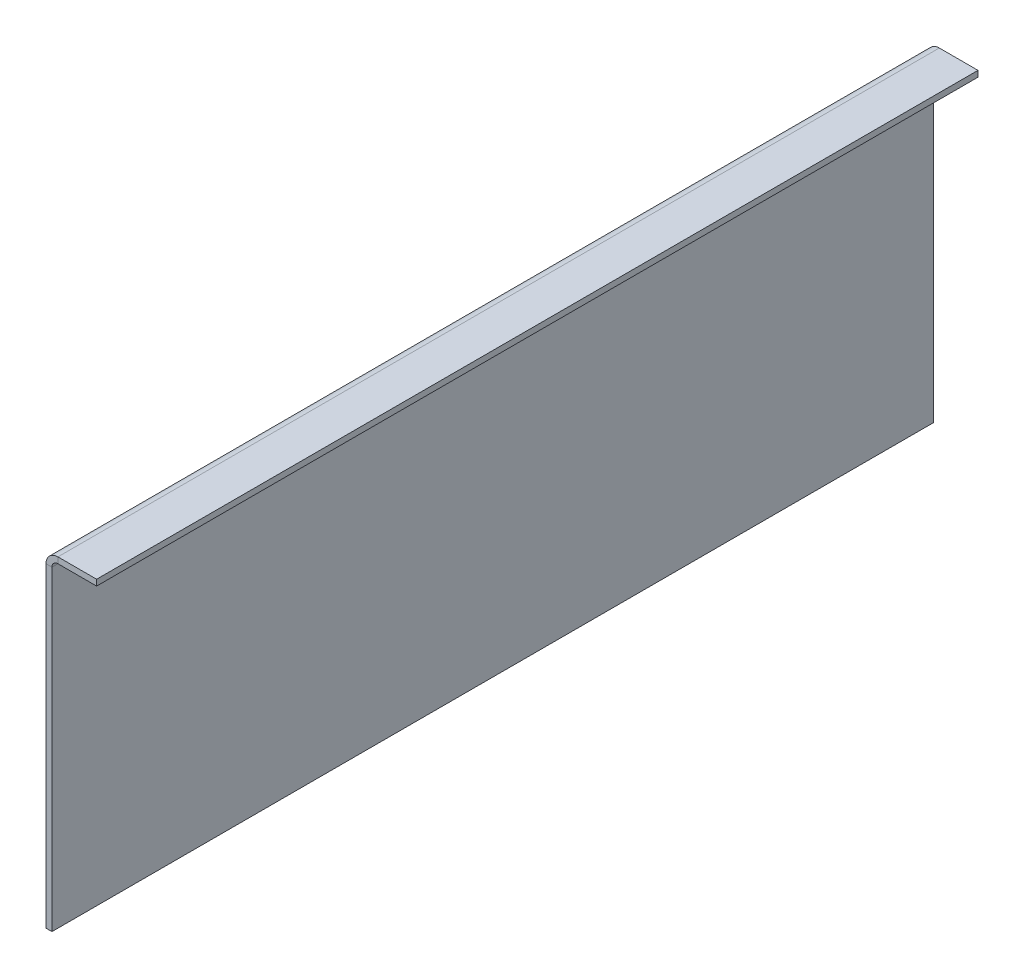
ISO-10303-21;
HEADER;
FILE_DESCRIPTION(('STEP AP214'),'2;1');
FILE_NAME('part.step','',(''),(''),'','','');
FILE_SCHEMA(('AUTOMOTIVE_DESIGN { 1 0 10303 214 1 1 1 1 }'));
ENDSEC;
DATA;
#1=APPLICATION_CONTEXT('core data for automotive mechanical design processes');
#2=APPLICATION_PROTOCOL_DEFINITION('international standard','automotive_design',2000,#1);
#3=PRODUCT_CONTEXT('',#1,'mechanical');
#4=PRODUCT('Part','Part','',(#3));
#5=PRODUCT_RELATED_PRODUCT_CATEGORY('part','',(#4));
#6=PRODUCT_DEFINITION_FORMATION('','',#4);
#7=PRODUCT_DEFINITION_CONTEXT('part definition',#1,'design');
#8=PRODUCT_DEFINITION('design','',#6,#7);
#9=PRODUCT_DEFINITION_SHAPE('','',#8);
#10=(LENGTH_UNIT() NAMED_UNIT(*) SI_UNIT(.MILLI.,.METRE.));
#11=(NAMED_UNIT(*) PLANE_ANGLE_UNIT() SI_UNIT($,.RADIAN.));
#12=(NAMED_UNIT(*) SI_UNIT($,.STERADIAN.) SOLID_ANGLE_UNIT());
#13=UNCERTAINTY_MEASURE_WITH_UNIT(LENGTH_MEASURE(1.E-05),#10,'distance_accuracy_value','');
#14=(GEOMETRIC_REPRESENTATION_CONTEXT(3) GLOBAL_UNCERTAINTY_ASSIGNED_CONTEXT((#13)) GLOBAL_UNIT_ASSIGNED_CONTEXT((#10,
#11,#12)) REPRESENTATION_CONTEXT('',''));
#15=CARTESIAN_POINT('',(0.,0.,0.));
#16=DIRECTION('',(0.,0.,1.));
#17=DIRECTION('',(1.,0.,0.));
#18=AXIS2_PLACEMENT_3D('',#15,#16,#17);
#19=CARTESIAN_POINT('',(17.,108.,-148.));
#20=DIRECTION('',(0.,0.,1.));
#21=DIRECTION('',(1.,0.,0.));
#22=AXIS2_PLACEMENT_3D('',#19,#20,#21);
#23=PLANE('',#22);
#24=DIRECTION('',(0.,-1.,0.));
#25=VECTOR('',#24,1.);
#26=CARTESIAN_POINT('',(3.99999999999999,108.,-148.));
#27=LINE('',#26,#25);
#28=CARTESIAN_POINT('',(3.99999999999999,110.,-148.));
#29=VERTEX_POINT('',#28);
#30=CARTESIAN_POINT('',(3.99999999999999,108.,-148.));
#31=VERTEX_POINT('',#30);
#32=EDGE_CURVE('E11',#29,#31,#27,.T.);
#33=ORIENTED_EDGE('',*,*,#32,.F.);
#34=DIRECTION('',(1.,0.,0.));
#35=VECTOR('',#34,1.);
#36=CARTESIAN_POINT('',(17.,110.,-148.));
#37=LINE('',#36,#35);
#38=CARTESIAN_POINT('',(17.,110.,-148.));
#39=VERTEX_POINT('',#38);
#40=EDGE_CURVE('E95',#29,#39,#37,.T.);
#41=ORIENTED_EDGE('',*,*,#40,.T.);
#42=DIRECTION('',(0.,-1.,0.));
#43=VECTOR('',#42,1.);
#44=CARTESIAN_POINT('',(17.,108.,-148.));
#45=LINE('',#44,#43);
#46=CARTESIAN_POINT('',(17.,108.,-148.));
#47=VERTEX_POINT('',#46);
#48=EDGE_CURVE('E55',#39,#47,#45,.T.);
#49=ORIENTED_EDGE('',*,*,#48,.T.);
#50=DIRECTION('',(1.,0.,0.));
#51=VECTOR('',#50,1.);
#52=CARTESIAN_POINT('',(17.,108.,-148.));
#53=LINE('',#52,#51);
#54=EDGE_CURVE('E98',#31,#47,#53,.T.);
#55=ORIENTED_EDGE('',*,*,#54,.F.);
#56=EDGE_LOOP('',(#33,#41,#49,#55));
#57=FACE_BOUND('',#56,.T.);
#58=ADVANCED_FACE('F45',(#57),#23,.F.);
#59=CARTESIAN_POINT('',(17.,108.,148.));
#60=DIRECTION('',(1.,0.,0.));
#61=DIRECTION('',(0.,0.,-1.));
#62=AXIS2_PLACEMENT_3D('',#59,#60,#61);
#63=PLANE('',#62);
#64=ORIENTED_EDGE('',*,*,#48,.F.);
#65=DIRECTION('',(0.,0.,1.));
#66=VECTOR('',#65,1.);
#67=CARTESIAN_POINT('',(17.,110.,148.));
#68=LINE('',#67,#66);
#69=CARTESIAN_POINT('',(17.,110.,148.));
#70=VERTEX_POINT('',#69);
#71=EDGE_CURVE('E123',#70,#39,#68,.F.);
#72=ORIENTED_EDGE('',*,*,#71,.F.);
#73=DIRECTION('',(0.,-1.,0.));
#74=VECTOR('',#73,1.);
#75=CARTESIAN_POINT('',(17.,108.,148.));
#76=LINE('',#75,#74);
#77=CARTESIAN_POINT('',(17.,108.,148.));
#78=VERTEX_POINT('',#77);
#79=EDGE_CURVE('E141',#70,#78,#76,.T.);
#80=ORIENTED_EDGE('',*,*,#79,.T.);
#81=DIRECTION('',(0.,0.,-1.));
#82=VECTOR('',#81,1.);
#83=CARTESIAN_POINT('',(17.,108.,148.));
#84=LINE('',#83,#82);
#85=EDGE_CURVE('E152',#78,#47,#84,.T.);
#86=ORIENTED_EDGE('',*,*,#85,.T.);
#87=EDGE_LOOP('',(#64,#72,#80,#86));
#88=FACE_BOUND('',#87,.T.);
#89=ADVANCED_FACE('F158',(#88),#63,.T.);
#90=CARTESIAN_POINT('',(17.,108.,148.));
#91=DIRECTION('',(0.,0.,1.));
#92=DIRECTION('',(1.,0.,0.));
#93=AXIS2_PLACEMENT_3D('',#90,#91,#92);
#94=PLANE('',#93);
#95=ORIENTED_EDGE('',*,*,#79,.F.);
#96=DIRECTION('',(1.,0.,0.));
#97=VECTOR('',#96,1.);
#98=CARTESIAN_POINT('',(17.,110.,148.));
#99=LINE('',#98,#97);
#100=CARTESIAN_POINT('',(3.99999999999999,110.,148.));
#101=VERTEX_POINT('',#100);
#102=EDGE_CURVE('E183',#101,#70,#99,.T.);
#103=ORIENTED_EDGE('',*,*,#102,.F.);
#104=DIRECTION('',(0.,-1.,0.));
#105=VECTOR('',#104,1.);
#106=CARTESIAN_POINT('',(3.99999999999999,108.,148.));
#107=LINE('',#106,#105);
#108=CARTESIAN_POINT('',(3.99999999999999,108.,148.));
#109=VERTEX_POINT('',#108);
#110=EDGE_CURVE('E138',#101,#109,#107,.T.);
#111=ORIENTED_EDGE('',*,*,#110,.T.);
#112=DIRECTION('',(1.,0.,0.));
#113=VECTOR('',#112,1.);
#114=CARTESIAN_POINT('',(17.,108.,148.));
#115=LINE('',#114,#113);
#116=EDGE_CURVE('E159',#109,#78,#115,.T.);
#117=ORIENTED_EDGE('',*,*,#116,.T.);
#118=EDGE_LOOP('',(#95,#103,#111,#117));
#119=FACE_BOUND('',#118,.T.);
#120=ADVANCED_FACE('F189',(#119),#94,.T.);
#121=CARTESIAN_POINT('',(3.99999999999999,106.,148.));
#122=DIRECTION('',(0.,0.,1.));
#123=DIRECTION('',(1.,0.,0.));
#124=AXIS2_PLACEMENT_3D('',#121,#122,#123);
#125=PLANE('',#124);
#126=ORIENTED_EDGE('',*,*,#110,.F.);
#127=CARTESIAN_POINT('',(3.99999999999999,106.,148.));
#128=DIRECTION('',(0.,0.,1.));
#129=DIRECTION('',(1.,0.,0.));
#130=AXIS2_PLACEMENT_3D('',#127,#128,#129);
#131=CIRCLE('',#130,4.);
#132=CARTESIAN_POINT('',(0.,106.,148.));
#133=VERTEX_POINT('',#132);
#134=EDGE_CURVE('E113',#101,#133,#131,.T.);
#135=ORIENTED_EDGE('',*,*,#134,.T.);
#136=DIRECTION('',(1.,0.,0.));
#137=VECTOR('',#136,1.);
#138=CARTESIAN_POINT('',(1.99999999999999,106.,148.));
#139=LINE('',#138,#137);
#140=CARTESIAN_POINT('',(1.99999999999999,106.,148.));
#141=VERTEX_POINT('',#140);
#142=EDGE_CURVE('E63',#133,#141,#139,.T.);
#143=ORIENTED_EDGE('',*,*,#142,.T.);
#144=CARTESIAN_POINT('',(3.99999999999999,106.,148.));
#145=DIRECTION('',(0.,0.,-1.));
#146=DIRECTION('',(-1.,0.,0.));
#147=AXIS2_PLACEMENT_3D('',#144,#145,#146);
#148=CIRCLE('',#147,2.);
#149=EDGE_CURVE('E156',#109,#141,#148,.F.);
#150=ORIENTED_EDGE('',*,*,#149,.F.);
#151=EDGE_LOOP('',(#126,#135,#143,#150));
#152=FACE_BOUND('',#151,.T.);
#153=ADVANCED_FACE('F192',(#152),#125,.T.);
#154=CARTESIAN_POINT('',(1.99999999999999,108.,148.));
#155=DIRECTION('',(0.,0.,1.));
#156=DIRECTION('',(0.,1.,0.));
#157=AXIS2_PLACEMENT_3D('',#154,#155,#156);
#158=PLANE('',#157);
#159=ORIENTED_EDGE('',*,*,#142,.F.);
#160=DIRECTION('',(0.,-1.,0.));
#161=VECTOR('',#160,1.);
#162=CARTESIAN_POINT('',(0.,108.,148.));
#163=LINE('',#162,#161);
#164=CARTESIAN_POINT('',(0.,0.,148.));
#165=VERTEX_POINT('',#164);
#166=EDGE_CURVE('E182',#165,#133,#163,.F.);
#167=ORIENTED_EDGE('',*,*,#166,.F.);
#168=DIRECTION('',(1.,0.,0.));
#169=VECTOR('',#168,1.);
#170=CARTESIAN_POINT('',(2.,0.,148.));
#171=LINE('',#170,#169);
#172=CARTESIAN_POINT('',(2.,0.,148.));
#173=VERTEX_POINT('',#172);
#174=EDGE_CURVE('E134',#165,#173,#171,.T.);
#175=ORIENTED_EDGE('',*,*,#174,.T.);
#176=DIRECTION('',(0.,1.,0.));
#177=VECTOR('',#176,1.);
#178=CARTESIAN_POINT('',(1.99999999999999,108.,148.));
#179=LINE('',#178,#177);
#180=EDGE_CURVE('E166',#173,#141,#179,.T.);
#181=ORIENTED_EDGE('',*,*,#180,.T.);
#182=EDGE_LOOP('',(#159,#167,#175,#181));
#183=FACE_BOUND('',#182,.T.);
#184=ADVANCED_FACE('F203',(#183),#158,.T.);
#185=CARTESIAN_POINT('',(2.,0.,148.));
#186=DIRECTION('',(0.,1.,0.));
#187=DIRECTION('',(0.,0.,-1.));
#188=AXIS2_PLACEMENT_3D('',#185,#186,#187);
#189=PLANE('',#188);
#190=ORIENTED_EDGE('',*,*,#174,.F.);
#191=DIRECTION('',(0.,0.,1.));
#192=VECTOR('',#191,1.);
#193=CARTESIAN_POINT('',(0.,0.,148.));
#194=LINE('',#193,#192);
#195=CARTESIAN_POINT('',(0.,0.,-148.));
#196=VERTEX_POINT('',#195);
#197=EDGE_CURVE('E118',#165,#196,#194,.F.);
#198=ORIENTED_EDGE('',*,*,#197,.T.);
#199=DIRECTION('',(1.,0.,0.));
#200=VECTOR('',#199,1.);
#201=CARTESIAN_POINT('',(2.,0.,-148.));
#202=LINE('',#201,#200);
#203=CARTESIAN_POINT('',(2.,0.,-148.));
#204=VERTEX_POINT('',#203);
#205=EDGE_CURVE('E131',#196,#204,#202,.T.);
#206=ORIENTED_EDGE('',*,*,#205,.T.);
#207=DIRECTION('',(0.,0.,-1.));
#208=VECTOR('',#207,1.);
#209=CARTESIAN_POINT('',(2.,0.,148.));
#210=LINE('',#209,#208);
#211=EDGE_CURVE('E169',#173,#204,#210,.T.);
#212=ORIENTED_EDGE('',*,*,#211,.F.);
#213=EDGE_LOOP('',(#190,#198,#206,#212));
#214=FACE_BOUND('',#213,.T.);
#215=ADVANCED_FACE('F209',(#214),#189,.F.);
#216=CARTESIAN_POINT('',(1.99999999999999,108.,-148.));
#217=DIRECTION('',(0.,0.,1.));
#218=DIRECTION('',(0.,1.,0.));
#219=AXIS2_PLACEMENT_3D('',#216,#217,#218);
#220=PLANE('',#219);
#221=ORIENTED_EDGE('',*,*,#205,.F.);
#222=DIRECTION('',(0.,-1.,0.));
#223=VECTOR('',#222,1.);
#224=CARTESIAN_POINT('',(0.,108.,-148.));
#225=LINE('',#224,#223);
#226=CARTESIAN_POINT('',(0.,106.,-148.));
#227=VERTEX_POINT('',#226);
#228=EDGE_CURVE('E180',#196,#227,#225,.F.);
#229=ORIENTED_EDGE('',*,*,#228,.T.);
#230=DIRECTION('',(1.,0.,0.));
#231=VECTOR('',#230,1.);
#232=CARTESIAN_POINT('',(1.99999999999999,106.,-148.));
#233=LINE('',#232,#231);
#234=CARTESIAN_POINT('',(1.99999999999999,106.,-148.));
#235=VERTEX_POINT('',#234);
#236=EDGE_CURVE('E49',#227,#235,#233,.T.);
#237=ORIENTED_EDGE('',*,*,#236,.T.);
#238=DIRECTION('',(0.,1.,0.));
#239=VECTOR('',#238,1.);
#240=CARTESIAN_POINT('',(1.99999999999999,108.,-148.));
#241=LINE('',#240,#239);
#242=EDGE_CURVE('E161',#204,#235,#241,.T.);
#243=ORIENTED_EDGE('',*,*,#242,.F.);
#244=EDGE_LOOP('',(#221,#229,#237,#243));
#245=FACE_BOUND('',#244,.T.);
#246=ADVANCED_FACE('F213',(#245),#220,.F.);
#247=CARTESIAN_POINT('',(3.99999999999999,106.,-148.));
#248=DIRECTION('',(0.,0.,-1.));
#249=DIRECTION('',(-1.,0.,0.));
#250=AXIS2_PLACEMENT_3D('',#247,#248,#249);
#251=PLANE('',#250);
#252=CARTESIAN_POINT('',(3.99999999999999,106.,-148.));
#253=DIRECTION('',(0.,0.,1.));
#254=DIRECTION('',(1.,0.,0.));
#255=AXIS2_PLACEMENT_3D('',#252,#253,#254);
#256=CIRCLE('',#255,4.);
#257=EDGE_CURVE('E111',#227,#29,#256,.F.);
#258=ORIENTED_EDGE('',*,*,#257,.T.);
#259=ORIENTED_EDGE('',*,*,#32,.T.);
#260=CARTESIAN_POINT('',(3.99999999999999,106.,-148.));
#261=DIRECTION('',(0.,0.,1.));
#262=DIRECTION('',(1.,0.,0.));
#263=AXIS2_PLACEMENT_3D('',#260,#261,#262);
#264=CIRCLE('',#263,2.);
#265=EDGE_CURVE('E176',#235,#31,#264,.F.);
#266=ORIENTED_EDGE('',*,*,#265,.F.);
#267=ORIENTED_EDGE('',*,*,#236,.F.);
#268=EDGE_LOOP('',(#258,#259,#266,#267));
#269=FACE_BOUND('',#268,.T.);
#270=ADVANCED_FACE('F47',(#269),#251,.T.);
#271=CARTESIAN_POINT('',(1.99999999999999,108.,148.));
#272=DIRECTION('',(-1.,0.,0.));
#273=DIRECTION('',(0.,-1.,0.));
#274=AXIS2_PLACEMENT_3D('',#271,#272,#273);
#275=PLANE('',#274);
#276=ORIENTED_EDGE('',*,*,#242,.T.);
#277=DIRECTION('',(0.,0.,-1.));
#278=VECTOR('',#277,1.);
#279=CARTESIAN_POINT('',(1.99999999999999,106.,148.));
#280=LINE('',#279,#278);
#281=EDGE_CURVE('E173',#235,#141,#280,.F.);
#282=ORIENTED_EDGE('',*,*,#281,.T.);
#283=ORIENTED_EDGE('',*,*,#180,.F.);
#284=ORIENTED_EDGE('',*,*,#211,.T.);
#285=EDGE_LOOP('',(#276,#282,#283,#284));
#286=FACE_BOUND('',#285,.T.);
#287=ADVANCED_FACE('F208',(#286),#275,.F.);
#288=CARTESIAN_POINT('',(17.,108.,148.));
#289=DIRECTION('',(0.,1.,0.));
#290=DIRECTION('',(0.,0.,1.));
#291=AXIS2_PLACEMENT_3D('',#288,#289,#290);
#292=PLANE('',#291);
#293=ORIENTED_EDGE('',*,*,#116,.F.);
#294=DIRECTION('',(0.,0.,-1.));
#295=VECTOR('',#294,1.);
#296=CARTESIAN_POINT('',(3.99999999999999,108.,-148.));
#297=LINE('',#296,#295);
#298=EDGE_CURVE('E155',#109,#31,#297,.T.);
#299=ORIENTED_EDGE('',*,*,#298,.T.);
#300=ORIENTED_EDGE('',*,*,#54,.T.);
#301=ORIENTED_EDGE('',*,*,#85,.F.);
#302=EDGE_LOOP('',(#293,#299,#300,#301));
#303=FACE_BOUND('',#302,.T.);
#304=ADVANCED_FACE('F151',(#303),#292,.F.);
#305=CARTESIAN_POINT('',(3.99999999999999,106.,148.));
#306=DIRECTION('',(0.,0.,1.));
#307=DIRECTION('',(1.,0.,0.));
#308=AXIS2_PLACEMENT_3D('',#305,#306,#307);
#309=CYLINDRICAL_SURFACE('',#308,2.);
#310=ORIENTED_EDGE('',*,*,#149,.T.);
#311=ORIENTED_EDGE('',*,*,#281,.F.);
#312=ORIENTED_EDGE('',*,*,#265,.T.);
#313=ORIENTED_EDGE('',*,*,#298,.F.);
#314=EDGE_LOOP('',(#310,#311,#312,#313));
#315=FACE_BOUND('',#314,.T.);
#316=ADVANCED_FACE('F195',(#315),#309,.F.);
#317=CARTESIAN_POINT('',(0.,108.,148.));
#318=DIRECTION('',(-1.,0.,0.));
#319=DIRECTION('',(0.,-1.,0.));
#320=AXIS2_PLACEMENT_3D('',#317,#318,#319);
#321=PLANE('',#320);
#322=ORIENTED_EDGE('',*,*,#228,.F.);
#323=ORIENTED_EDGE('',*,*,#197,.F.);
#324=ORIENTED_EDGE('',*,*,#166,.T.);
#325=DIRECTION('',(0.,0.,1.));
#326=VECTOR('',#325,1.);
#327=CARTESIAN_POINT('',(0.,106.,148.));
#328=LINE('',#327,#326);
#329=EDGE_CURVE('E117',#227,#133,#328,.T.);
#330=ORIENTED_EDGE('',*,*,#329,.F.);
#331=EDGE_LOOP('',(#322,#323,#324,#330));
#332=FACE_BOUND('',#331,.T.);
#333=ADVANCED_FACE('F215',(#332),#321,.T.);
#334=CARTESIAN_POINT('',(17.,110.,148.));
#335=DIRECTION('',(0.,1.,0.));
#336=DIRECTION('',(0.,0.,1.));
#337=AXIS2_PLACEMENT_3D('',#334,#335,#336);
#338=PLANE('',#337);
#339=ORIENTED_EDGE('',*,*,#102,.T.);
#340=ORIENTED_EDGE('',*,*,#71,.T.);
#341=ORIENTED_EDGE('',*,*,#40,.F.);
#342=DIRECTION('',(0.,0.,1.));
#343=VECTOR('',#342,1.);
#344=CARTESIAN_POINT('',(3.99999999999999,110.,148.));
#345=LINE('',#344,#343);
#346=EDGE_CURVE('E108',#101,#29,#345,.F.);
#347=ORIENTED_EDGE('',*,*,#346,.F.);
#348=EDGE_LOOP('',(#339,#340,#341,#347));
#349=FACE_BOUND('',#348,.T.);
#350=ADVANCED_FACE('F121',(#349),#338,.T.);
#351=CARTESIAN_POINT('',(3.99999999999999,106.,148.));
#352=DIRECTION('',(0.,0.,1.));
#353=DIRECTION('',(1.,0.,0.));
#354=AXIS2_PLACEMENT_3D('',#351,#352,#353);
#355=CYLINDRICAL_SURFACE('',#354,4.);
#356=ORIENTED_EDGE('',*,*,#134,.F.);
#357=ORIENTED_EDGE('',*,*,#346,.T.);
#358=ORIENTED_EDGE('',*,*,#257,.F.);
#359=ORIENTED_EDGE('',*,*,#329,.T.);
#360=EDGE_LOOP('',(#356,#357,#358,#359));
#361=FACE_BOUND('',#360,.T.);
#362=ADVANCED_FACE('F109',(#361),#355,.T.);
#363=CLOSED_SHELL('',(#58,#89,#120,#153,#184,#215,#246,#270,#287,#304,#316,#333,#350,#362));
#364=MANIFOLD_SOLID_BREP('B2',#363);
#365=ADVANCED_BREP_SHAPE_REPRESENTATION('',(#18,#364),#14);
#366=SHAPE_DEFINITION_REPRESENTATION(#9,#365);
ENDSEC;
END-ISO-10303-21;
